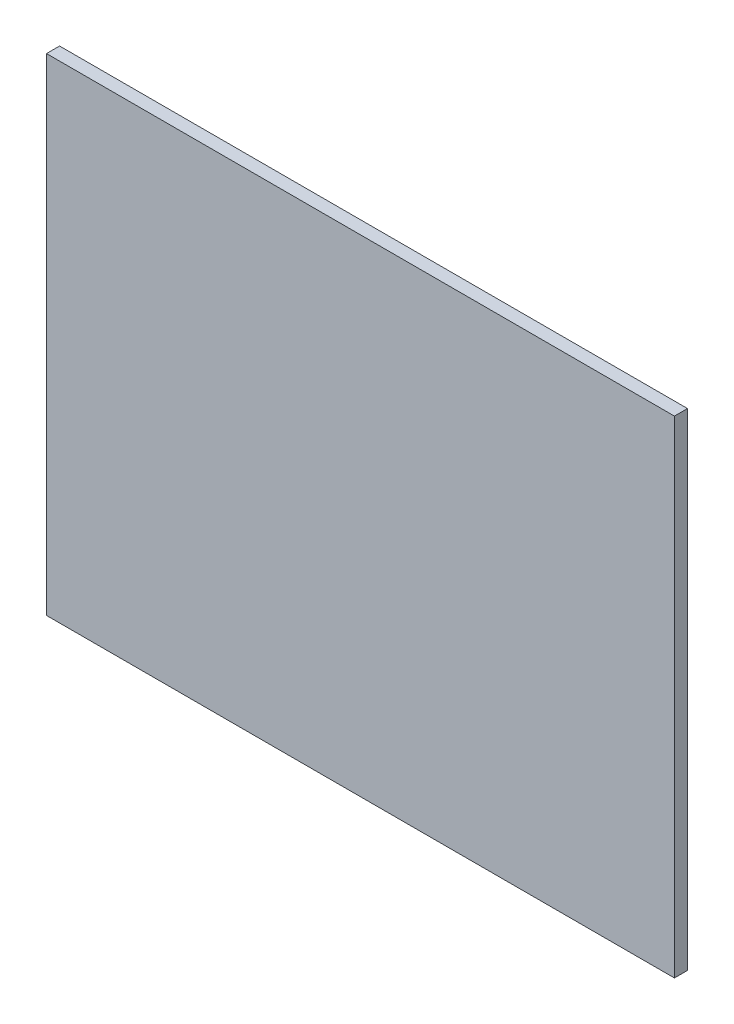
ISO-10303-21;
HEADER;
FILE_DESCRIPTION(('STEP AP214'),'2;1');
FILE_NAME('part.step','',(''),(''),'','','');
FILE_SCHEMA(('AUTOMOTIVE_DESIGN { 1 0 10303 214 1 1 1 1 }'));
ENDSEC;
DATA;
#1=APPLICATION_CONTEXT('core data for automotive mechanical design processes');
#2=APPLICATION_PROTOCOL_DEFINITION('international standard','automotive_design',2000,#1);
#3=PRODUCT_CONTEXT('',#1,'mechanical');
#4=PRODUCT('Part','Part','',(#3));
#5=PRODUCT_RELATED_PRODUCT_CATEGORY('part','',(#4));
#6=PRODUCT_DEFINITION_FORMATION('','',#4);
#7=PRODUCT_DEFINITION_CONTEXT('part definition',#1,'design');
#8=PRODUCT_DEFINITION('design','',#6,#7);
#9=PRODUCT_DEFINITION_SHAPE('','',#8);
#10=(LENGTH_UNIT() NAMED_UNIT(*) SI_UNIT(.MILLI.,.METRE.));
#11=(NAMED_UNIT(*) PLANE_ANGLE_UNIT() SI_UNIT($,.RADIAN.));
#12=(NAMED_UNIT(*) SI_UNIT($,.STERADIAN.) SOLID_ANGLE_UNIT());
#13=UNCERTAINTY_MEASURE_WITH_UNIT(LENGTH_MEASURE(1.E-05),#10,'distance_accuracy_value','');
#14=(GEOMETRIC_REPRESENTATION_CONTEXT(3) GLOBAL_UNCERTAINTY_ASSIGNED_CONTEXT((#13)) GLOBAL_UNIT_ASSIGNED_CONTEXT((#10,
#11,#12)) REPRESENTATION_CONTEXT('',''));
#15=CARTESIAN_POINT('',(0.,0.,0.));
#16=DIRECTION('',(0.,0.,1.));
#17=DIRECTION('',(1.,0.,0.));
#18=AXIS2_PLACEMENT_3D('',#15,#16,#17);
#19=CARTESIAN_POINT('',(-77.4595041322314,37.9425619834711,3.175));
#20=DIRECTION('',(1.,0.,0.));
#21=DIRECTION('',(0.,1.,0.));
#22=AXIS2_PLACEMENT_3D('',#19,#20,#21);
#23=PLANE('',#22);
#24=DIRECTION('',(0.,-1.,0.));
#25=VECTOR('',#24,1.);
#26=CARTESIAN_POINT('',(-77.4595041322314,37.9425619834711,0.));
#27=LINE('',#26,#25);
#28=CARTESIAN_POINT('',(-77.4595041322314,37.9425619834711,0.));
#29=VERTEX_POINT('',#28);
#30=CARTESIAN_POINT('',(-77.4595041322314,-80.1674380165289,0.));
#31=VERTEX_POINT('',#30);
#32=EDGE_CURVE('E96',#29,#31,#27,.T.);
#33=ORIENTED_EDGE('',*,*,#32,.T.);
#34=DIRECTION('',(0.,0.,-1.));
#35=VECTOR('',#34,1.);
#36=CARTESIAN_POINT('',(-77.4595041322314,-80.1674380165289,3.175));
#37=LINE('',#36,#35);
#38=CARTESIAN_POINT('',(-77.4595041322314,-80.1674380165289,3.175));
#39=VERTEX_POINT('',#38);
#40=EDGE_CURVE('E11',#39,#31,#37,.T.);
#41=ORIENTED_EDGE('',*,*,#40,.F.);
#42=DIRECTION('',(0.,-1.,0.));
#43=VECTOR('',#42,1.);
#44=CARTESIAN_POINT('',(-77.4595041322314,37.9425619834711,3.175));
#45=LINE('',#44,#43);
#46=CARTESIAN_POINT('',(-77.4595041322314,37.9425619834711,3.175));
#47=VERTEX_POINT('',#46);
#48=EDGE_CURVE('E84',#47,#39,#45,.T.);
#49=ORIENTED_EDGE('',*,*,#48,.F.);
#50=DIRECTION('',(0.,0.,-1.));
#51=VECTOR('',#50,1.);
#52=CARTESIAN_POINT('',(-77.4595041322314,37.9425619834711,3.175));
#53=LINE('',#52,#51);
#54=EDGE_CURVE('E92',#47,#29,#53,.T.);
#55=ORIENTED_EDGE('',*,*,#54,.T.);
#56=EDGE_LOOP('',(#33,#41,#49,#55));
#57=FACE_BOUND('',#56,.T.);
#58=ADVANCED_FACE('F33',(#57),#23,.F.);
#59=CARTESIAN_POINT('',(-77.4595041322314,-80.1674380165289,3.175));
#60=DIRECTION('',(0.,1.,0.));
#61=DIRECTION('',(0.,0.,1.));
#62=AXIS2_PLACEMENT_3D('',#59,#60,#61);
#63=PLANE('',#62);
#64=DIRECTION('',(1.,0.,0.));
#65=VECTOR('',#64,1.);
#66=CARTESIAN_POINT('',(-77.4595041322314,-80.1674380165289,0.));
#67=LINE('',#66,#65);
#68=CARTESIAN_POINT('',(74.9404958677686,-80.1674380165289,0.));
#69=VERTEX_POINT('',#68);
#70=EDGE_CURVE('E88',#31,#69,#67,.T.);
#71=ORIENTED_EDGE('',*,*,#70,.T.);
#72=DIRECTION('',(0.,0.,-1.));
#73=VECTOR('',#72,1.);
#74=CARTESIAN_POINT('',(74.9404958677686,-80.1674380165289,3.175));
#75=LINE('',#74,#73);
#76=CARTESIAN_POINT('',(74.9404958677686,-80.1674380165289,3.175));
#77=VERTEX_POINT('',#76);
#78=EDGE_CURVE('E41',#77,#69,#75,.T.);
#79=ORIENTED_EDGE('',*,*,#78,.F.);
#80=DIRECTION('',(1.,0.,0.));
#81=VECTOR('',#80,1.);
#82=CARTESIAN_POINT('',(-77.4595041322314,-80.1674380165289,3.175));
#83=LINE('',#82,#81);
#84=EDGE_CURVE('E79',#39,#77,#83,.T.);
#85=ORIENTED_EDGE('',*,*,#84,.F.);
#86=ORIENTED_EDGE('',*,*,#40,.T.);
#87=EDGE_LOOP('',(#71,#79,#85,#86));
#88=FACE_BOUND('',#87,.T.);
#89=ADVANCED_FACE('F87',(#88),#63,.F.);
#90=CARTESIAN_POINT('',(74.9404958677686,37.9425619834711,3.175));
#91=DIRECTION('',(-1.,0.,0.));
#92=DIRECTION('',(0.,-1.,0.));
#93=AXIS2_PLACEMENT_3D('',#90,#91,#92);
#94=PLANE('',#93);
#95=DIRECTION('',(0.,1.,0.));
#96=VECTOR('',#95,1.);
#97=CARTESIAN_POINT('',(74.9404958677686,37.9425619834711,0.));
#98=LINE('',#97,#96);
#99=CARTESIAN_POINT('',(74.9404958677686,37.9425619834711,0.));
#100=VERTEX_POINT('',#99);
#101=EDGE_CURVE('E66',#69,#100,#98,.T.);
#102=ORIENTED_EDGE('',*,*,#101,.T.);
#103=DIRECTION('',(0.,0.,-1.));
#104=VECTOR('',#103,1.);
#105=CARTESIAN_POINT('',(74.9404958677686,37.9425619834711,3.175));
#106=LINE('',#105,#104);
#107=CARTESIAN_POINT('',(74.9404958677686,37.9425619834711,3.175));
#108=VERTEX_POINT('',#107);
#109=EDGE_CURVE('E89',#108,#100,#106,.T.);
#110=ORIENTED_EDGE('',*,*,#109,.F.);
#111=DIRECTION('',(0.,1.,0.));
#112=VECTOR('',#111,1.);
#113=CARTESIAN_POINT('',(74.9404958677686,37.9425619834711,3.175));
#114=LINE('',#113,#112);
#115=EDGE_CURVE('E82',#77,#108,#114,.T.);
#116=ORIENTED_EDGE('',*,*,#115,.F.);
#117=ORIENTED_EDGE('',*,*,#78,.T.);
#118=EDGE_LOOP('',(#102,#110,#116,#117));
#119=FACE_BOUND('',#118,.T.);
#120=ADVANCED_FACE('F90',(#119),#94,.F.);
#121=CARTESIAN_POINT('',(-77.4595041322314,37.9425619834711,3.175));
#122=DIRECTION('',(0.,-1.,0.));
#123=DIRECTION('',(0.,0.,-1.));
#124=AXIS2_PLACEMENT_3D('',#121,#122,#123);
#125=PLANE('',#124);
#126=DIRECTION('',(-1.,0.,0.));
#127=VECTOR('',#126,1.);
#128=CARTESIAN_POINT('',(-77.4595041322314,37.9425619834711,0.));
#129=LINE('',#128,#127);
#130=EDGE_CURVE('E72',#100,#29,#129,.T.);
#131=ORIENTED_EDGE('',*,*,#130,.T.);
#132=ORIENTED_EDGE('',*,*,#54,.F.);
#133=DIRECTION('',(-1.,0.,0.));
#134=VECTOR('',#133,1.);
#135=CARTESIAN_POINT('',(-77.4595041322314,37.9425619834711,3.175));
#136=LINE('',#135,#134);
#137=EDGE_CURVE('E49',#108,#47,#136,.T.);
#138=ORIENTED_EDGE('',*,*,#137,.F.);
#139=ORIENTED_EDGE('',*,*,#109,.T.);
#140=EDGE_LOOP('',(#131,#132,#138,#139));
#141=FACE_BOUND('',#140,.T.);
#142=ADVANCED_FACE('F103',(#141),#125,.F.);
#143=CARTESIAN_POINT('',(0.,0.,3.175));
#144=DIRECTION('',(0.,0.,1.));
#145=DIRECTION('',(1.,0.,0.));
#146=AXIS2_PLACEMENT_3D('',#143,#144,#145);
#147=PLANE('',#146);
#148=ORIENTED_EDGE('',*,*,#48,.T.);
#149=ORIENTED_EDGE('',*,*,#84,.T.);
#150=ORIENTED_EDGE('',*,*,#115,.T.);
#151=ORIENTED_EDGE('',*,*,#137,.T.);
#152=EDGE_LOOP('',(#148,#149,#150,#151));
#153=FACE_BOUND('',#152,.T.);
#154=ADVANCED_FACE('F80',(#153),#147,.T.);
#155=CARTESIAN_POINT('',(0.,0.,0.));
#156=DIRECTION('',(0.,0.,1.));
#157=DIRECTION('',(1.,0.,0.));
#158=AXIS2_PLACEMENT_3D('',#155,#156,#157);
#159=PLANE('',#158);
#160=ORIENTED_EDGE('',*,*,#32,.F.);
#161=ORIENTED_EDGE('',*,*,#130,.F.);
#162=ORIENTED_EDGE('',*,*,#101,.F.);
#163=ORIENTED_EDGE('',*,*,#70,.F.);
#164=EDGE_LOOP('',(#160,#161,#162,#163));
#165=FACE_BOUND('',#164,.T.);
#166=ADVANCED_FACE('F106',(#165),#159,.F.);
#167=CLOSED_SHELL('',(#58,#89,#120,#142,#154,#166));
#168=MANIFOLD_SOLID_BREP('B2',#167);
#169=ADVANCED_BREP_SHAPE_REPRESENTATION('',(#18,#168),#14);
#170=SHAPE_DEFINITION_REPRESENTATION(#9,#169);
ENDSEC;
END-ISO-10303-21;
